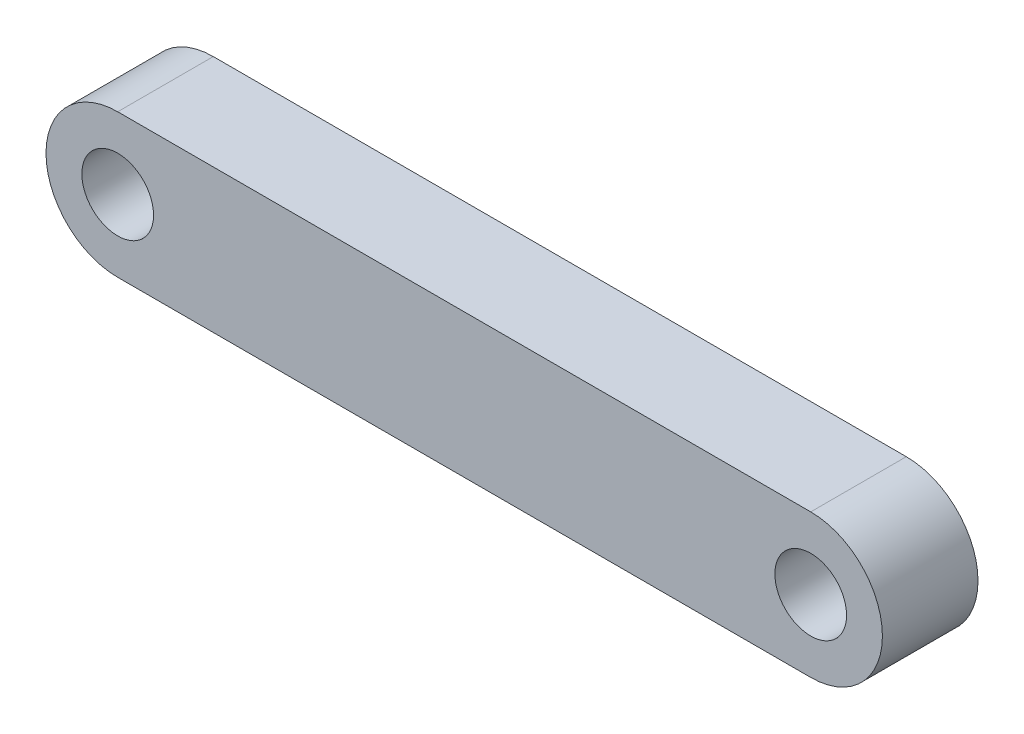
ISO-10303-21;
HEADER;
FILE_DESCRIPTION(('STEP AP214'),'2;1');
FILE_NAME('part.step','',(''),(''),'','','');
FILE_SCHEMA(('AUTOMOTIVE_DESIGN { 1 0 10303 214 1 1 1 1 }'));
ENDSEC;
DATA;
#1=APPLICATION_CONTEXT('core data for automotive mechanical design processes');
#2=APPLICATION_PROTOCOL_DEFINITION('international standard','automotive_design',2000,#1);
#3=PRODUCT_CONTEXT('',#1,'mechanical');
#4=PRODUCT('Part','Part','',(#3));
#5=PRODUCT_RELATED_PRODUCT_CATEGORY('part','',(#4));
#6=PRODUCT_DEFINITION_FORMATION('','',#4);
#7=PRODUCT_DEFINITION_CONTEXT('part definition',#1,'design');
#8=PRODUCT_DEFINITION('design','',#6,#7);
#9=PRODUCT_DEFINITION_SHAPE('','',#8);
#10=(LENGTH_UNIT() NAMED_UNIT(*) SI_UNIT(.MILLI.,.METRE.));
#11=(NAMED_UNIT(*) PLANE_ANGLE_UNIT() SI_UNIT($,.RADIAN.));
#12=(NAMED_UNIT(*) SI_UNIT($,.STERADIAN.) SOLID_ANGLE_UNIT());
#13=UNCERTAINTY_MEASURE_WITH_UNIT(LENGTH_MEASURE(1.E-05),#10,'distance_accuracy_value','');
#14=(GEOMETRIC_REPRESENTATION_CONTEXT(3) GLOBAL_UNCERTAINTY_ASSIGNED_CONTEXT((#13)) GLOBAL_UNIT_ASSIGNED_CONTEXT((#10,
#11,#12)) REPRESENTATION_CONTEXT('',''));
#15=CARTESIAN_POINT('',(0.,0.,0.));
#16=DIRECTION('',(0.,0.,1.));
#17=DIRECTION('',(1.,0.,0.));
#18=AXIS2_PLACEMENT_3D('',#15,#16,#17);
#19=CARTESIAN_POINT('',(3.00000002165552,3.00000002607703,8.00000018998981));
#20=DIRECTION('',(0.,0.,1.));
#21=DIRECTION('',(1.,0.,0.));
#22=AXIS2_PLACEMENT_3D('',#19,#20,#21);
#23=PLANE('',#22);
#24=CARTESIAN_POINT('',(2.99999964016233,3.00000008428469,8.00000018998981));
#25=DIRECTION('',(0.,0.,1.));
#26=DIRECTION('',(1.,0.,0.));
#27=AXIS2_PLACEMENT_3D('',#24,#25,#26);
#28=CIRCLE('',#27,1.49999993908166);
#29=CARTESIAN_POINT('',(4.49999957924399,3.00000008428469,8.00000018998981));
#30=VERTEX_POINT('',#29);
#31=EDGE_CURVE('E116',#30,#30,#28,.T.);
#32=ORIENTED_EDGE('',*,*,#31,.F.);
#33=EDGE_LOOP('',(#32));
#34=FACE_BOUND('',#33,.T.);
#35=CARTESIAN_POINT('',(3.00000002165552,3.00000002607703,8.00000018998981));
#36=DIRECTION('',(0.,0.,1.));
#37=DIRECTION('',(1.,0.,0.));
#38=AXIS2_PLACEMENT_3D('',#35,#36,#37);
#39=CIRCLE('',#38,3.00000002607703);
#40=CARTESIAN_POINT('',(3.00000002165552,6.00000005215406,8.00000018998981));
#41=VERTEX_POINT('',#40);
#42=CARTESIAN_POINT('',(3.00000002165552,0.,8.00000018998981));
#43=VERTEX_POINT('',#42);
#44=EDGE_CURVE('E96',#41,#43,#39,.T.);
#45=ORIENTED_EDGE('',*,*,#44,.T.);
#46=DIRECTION('',(1.,0.,0.));
#47=VECTOR('',#46,1.);
#48=CARTESIAN_POINT('',(3.00000002165552,0.,8.00000018998981));
#49=LINE('',#48,#47);
#50=CARTESIAN_POINT('',(31.9999983747598,0.,8.00000018998981));
#51=VERTEX_POINT('',#50);
#52=EDGE_CURVE('E91',#43,#51,#49,.T.);
#53=ORIENTED_EDGE('',*,*,#52,.T.);
#54=CARTESIAN_POINT('',(31.9999983747598,3.00000002607704,8.00000018998981));
#55=DIRECTION('',(0.,0.,1.));
#56=DIRECTION('',(1.,0.,0.));
#57=AXIS2_PLACEMENT_3D('',#54,#55,#56);
#58=CIRCLE('',#57,3.00000002607707);
#59=CARTESIAN_POINT('',(31.9999983747598,6.00000005215412,8.00000018998981));
#60=VERTEX_POINT('',#59);
#61=EDGE_CURVE('E94',#51,#60,#58,.T.);
#62=ORIENTED_EDGE('',*,*,#61,.T.);
#63=DIRECTION('',(-1.,0.,0.));
#64=VECTOR('',#63,1.);
#65=CARTESIAN_POINT('',(3.00000002165552,6.00000005215406,8.00000018998981));
#66=LINE('',#65,#64);
#67=EDGE_CURVE('E61',#60,#41,#66,.T.);
#68=ORIENTED_EDGE('',*,*,#67,.T.);
#69=EDGE_LOOP('',(#45,#53,#62,#68));
#70=FACE_BOUND('',#69,.T.);
#71=CARTESIAN_POINT('',(31.9999991781228,3.00000002607703,8.00000018998981));
#72=DIRECTION('',(0.,0.,1.));
#73=DIRECTION('',(1.,0.,0.));
#74=AXIS2_PLACEMENT_3D('',#71,#72,#73);
#75=CIRCLE('',#74,1.50000002704519);
#76=CARTESIAN_POINT('',(33.499999205168,3.00000002607703,8.00000018998981));
#77=VERTEX_POINT('',#76);
#78=EDGE_CURVE('E138',#77,#77,#75,.T.);
#79=ORIENTED_EDGE('',*,*,#78,.F.);
#80=EDGE_LOOP('',(#79));
#81=FACE_BOUND('',#80,.T.);
#82=ADVANCED_FACE('F43',(#34,#70,#81),#23,.T.);
#83=CARTESIAN_POINT('',(3.00000002165552,3.00000002607703,4.00000018998981));
#84=DIRECTION('',(0.,0.,1.));
#85=DIRECTION('',(1.,0.,0.));
#86=AXIS2_PLACEMENT_3D('',#83,#84,#85);
#87=PLANE('',#86);
#88=CARTESIAN_POINT('',(3.00000002165552,3.00000002607703,4.00000018998981));
#89=DIRECTION('',(0.,0.,1.));
#90=DIRECTION('',(1.,0.,0.));
#91=AXIS2_PLACEMENT_3D('',#88,#89,#90);
#92=CIRCLE('',#91,3.00000002607703);
#93=CARTESIAN_POINT('',(3.00000002165552,6.00000005215406,4.00000018998981));
#94=VERTEX_POINT('',#93);
#95=CARTESIAN_POINT('',(3.00000002165552,0.,4.00000018998981));
#96=VERTEX_POINT('',#95);
#97=EDGE_CURVE('E112',#94,#96,#92,.T.);
#98=ORIENTED_EDGE('',*,*,#97,.F.);
#99=DIRECTION('',(-1.,0.,0.));
#100=VECTOR('',#99,1.);
#101=CARTESIAN_POINT('',(3.00000002165552,6.00000005215406,4.00000018998981));
#102=LINE('',#101,#100);
#103=CARTESIAN_POINT('',(31.9999983747598,6.00000005215412,4.00000018998981));
#104=VERTEX_POINT('',#103);
#105=EDGE_CURVE('E84',#104,#94,#102,.T.);
#106=ORIENTED_EDGE('',*,*,#105,.F.);
#107=CARTESIAN_POINT('',(31.9999983747598,3.00000002607704,4.00000018998981));
#108=DIRECTION('',(0.,0.,1.));
#109=DIRECTION('',(1.,0.,0.));
#110=AXIS2_PLACEMENT_3D('',#107,#108,#109);
#111=CIRCLE('',#110,3.00000002607707);
#112=CARTESIAN_POINT('',(31.9999983747598,0.,4.00000018998981));
#113=VERTEX_POINT('',#112);
#114=EDGE_CURVE('E78',#113,#104,#111,.T.);
#115=ORIENTED_EDGE('',*,*,#114,.F.);
#116=DIRECTION('',(1.,0.,0.));
#117=VECTOR('',#116,1.);
#118=CARTESIAN_POINT('',(3.00000002165552,0.,4.00000018998981));
#119=LINE('',#118,#117);
#120=EDGE_CURVE('E101',#96,#113,#119,.T.);
#121=ORIENTED_EDGE('',*,*,#120,.F.);
#122=EDGE_LOOP('',(#98,#106,#115,#121));
#123=FACE_BOUND('',#122,.T.);
#124=CARTESIAN_POINT('',(2.99999964016233,3.00000008428469,4.00000018998981));
#125=DIRECTION('',(0.,0.,1.));
#126=DIRECTION('',(1.,0.,0.));
#127=AXIS2_PLACEMENT_3D('',#124,#125,#126);
#128=CIRCLE('',#127,1.49999993908166);
#129=CARTESIAN_POINT('',(4.49999957924399,3.00000008428469,4.00000018998981));
#130=VERTEX_POINT('',#129);
#131=EDGE_CURVE('E134',#130,#130,#128,.T.);
#132=ORIENTED_EDGE('',*,*,#131,.T.);
#133=EDGE_LOOP('',(#132));
#134=FACE_BOUND('',#133,.T.);
#135=CARTESIAN_POINT('',(31.9999991781228,3.00000002607703,4.00000018998981));
#136=DIRECTION('',(0.,0.,1.));
#137=DIRECTION('',(1.,0.,0.));
#138=AXIS2_PLACEMENT_3D('',#135,#136,#137);
#139=CIRCLE('',#138,1.50000002704519);
#140=CARTESIAN_POINT('',(33.499999205168,3.00000002607703,4.00000018998981));
#141=VERTEX_POINT('',#140);
#142=EDGE_CURVE('E142',#141,#141,#139,.T.);
#143=ORIENTED_EDGE('',*,*,#142,.T.);
#144=EDGE_LOOP('',(#143));
#145=FACE_BOUND('',#144,.T.);
#146=ADVANCED_FACE('F129',(#123,#134,#145),#87,.F.);
#147=CARTESIAN_POINT('',(3.00000002165552,3.00000002607703,8.00000018998981));
#148=DIRECTION('',(0.,0.,-1.));
#149=DIRECTION('',(-1.,0.,0.));
#150=AXIS2_PLACEMENT_3D('',#147,#148,#149);
#151=CYLINDRICAL_SURFACE('',#150,3.00000002607703);
#152=ORIENTED_EDGE('',*,*,#97,.T.);
#153=DIRECTION('',(0.,0.,-1.));
#154=VECTOR('',#153,1.);
#155=CARTESIAN_POINT('',(3.00000002165552,0.,8.00000018998981));
#156=LINE('',#155,#154);
#157=EDGE_CURVE('E11',#43,#96,#156,.T.);
#158=ORIENTED_EDGE('',*,*,#157,.F.);
#159=ORIENTED_EDGE('',*,*,#44,.F.);
#160=DIRECTION('',(0.,0.,-1.));
#161=VECTOR('',#160,1.);
#162=CARTESIAN_POINT('',(3.00000002165552,6.00000005215406,8.00000018998981));
#163=LINE('',#162,#161);
#164=EDGE_CURVE('E108',#41,#94,#163,.T.);
#165=ORIENTED_EDGE('',*,*,#164,.T.);
#166=EDGE_LOOP('',(#152,#158,#159,#165));
#167=FACE_BOUND('',#166,.T.);
#168=ADVANCED_FACE('F45',(#167),#151,.T.);
#169=CARTESIAN_POINT('',(3.00000002165552,0.,8.00000018998981));
#170=DIRECTION('',(0.,1.,0.));
#171=DIRECTION('',(-1.,0.,0.));
#172=AXIS2_PLACEMENT_3D('',#169,#170,#171);
#173=PLANE('',#172);
#174=ORIENTED_EDGE('',*,*,#120,.T.);
#175=DIRECTION('',(0.,0.,-1.));
#176=VECTOR('',#175,1.);
#177=CARTESIAN_POINT('',(31.9999983747598,0.,8.00000018998981));
#178=LINE('',#177,#176);
#179=EDGE_CURVE('E53',#51,#113,#178,.T.);
#180=ORIENTED_EDGE('',*,*,#179,.F.);
#181=ORIENTED_EDGE('',*,*,#52,.F.);
#182=ORIENTED_EDGE('',*,*,#157,.T.);
#183=EDGE_LOOP('',(#174,#180,#181,#182));
#184=FACE_BOUND('',#183,.T.);
#185=ADVANCED_FACE('F100',(#184),#173,.F.);
#186=CARTESIAN_POINT('',(31.9999983747598,3.00000002607704,8.00000018998981));
#187=DIRECTION('',(0.,0.,-1.));
#188=DIRECTION('',(-1.,0.,0.));
#189=AXIS2_PLACEMENT_3D('',#186,#187,#188);
#190=CYLINDRICAL_SURFACE('',#189,3.00000002607707);
#191=ORIENTED_EDGE('',*,*,#114,.T.);
#192=DIRECTION('',(0.,0.,-1.));
#193=VECTOR('',#192,1.);
#194=CARTESIAN_POINT('',(31.9999983747598,6.00000005215412,8.00000018998981));
#195=LINE('',#194,#193);
#196=EDGE_CURVE('E103',#60,#104,#195,.T.);
#197=ORIENTED_EDGE('',*,*,#196,.F.);
#198=ORIENTED_EDGE('',*,*,#61,.F.);
#199=ORIENTED_EDGE('',*,*,#179,.T.);
#200=EDGE_LOOP('',(#191,#197,#198,#199));
#201=FACE_BOUND('',#200,.T.);
#202=ADVANCED_FACE('F104',(#201),#190,.T.);
#203=CARTESIAN_POINT('',(3.00000002165552,6.00000005215406,8.00000018998981));
#204=DIRECTION('',(0.,-1.,0.));
#205=DIRECTION('',(1.,0.,0.));
#206=AXIS2_PLACEMENT_3D('',#203,#204,#205);
#207=PLANE('',#206);
#208=ORIENTED_EDGE('',*,*,#105,.T.);
#209=ORIENTED_EDGE('',*,*,#164,.F.);
#210=ORIENTED_EDGE('',*,*,#67,.F.);
#211=ORIENTED_EDGE('',*,*,#196,.T.);
#212=EDGE_LOOP('',(#208,#209,#210,#211));
#213=FACE_BOUND('',#212,.T.);
#214=ADVANCED_FACE('F126',(#213),#207,.F.);
#215=CARTESIAN_POINT('',(2.99999964016233,3.00000008428469,8.00000018998981));
#216=DIRECTION('',(0.,0.,-1.));
#217=DIRECTION('',(-1.,0.,0.));
#218=AXIS2_PLACEMENT_3D('',#215,#216,#217);
#219=CYLINDRICAL_SURFACE('',#218,1.49999993908166);
#220=ORIENTED_EDGE('',*,*,#31,.T.);
#221=EDGE_LOOP('',(#220));
#222=FACE_BOUND('',#221,.T.);
#223=ORIENTED_EDGE('',*,*,#131,.F.);
#224=EDGE_LOOP('',(#223));
#225=FACE_BOUND('',#224,.T.);
#226=ADVANCED_FACE('F161',(#222,#225),#219,.F.);
#227=CARTESIAN_POINT('',(31.9999991781228,3.00000002607703,8.00000018998981));
#228=DIRECTION('',(0.,0.,-1.));
#229=DIRECTION('',(-1.,0.,0.));
#230=AXIS2_PLACEMENT_3D('',#227,#228,#229);
#231=CYLINDRICAL_SURFACE('',#230,1.50000002704519);
#232=ORIENTED_EDGE('',*,*,#78,.T.);
#233=EDGE_LOOP('',(#232));
#234=FACE_BOUND('',#233,.T.);
#235=ORIENTED_EDGE('',*,*,#142,.F.);
#236=EDGE_LOOP('',(#235));
#237=FACE_BOUND('',#236,.T.);
#238=ADVANCED_FACE('F150',(#234,#237),#231,.F.);
#239=CLOSED_SHELL('',(#82,#146,#168,#185,#202,#214,#226,#238));
#240=MANIFOLD_SOLID_BREP('B2',#239);
#241=ADVANCED_BREP_SHAPE_REPRESENTATION('',(#18,#240),#14);
#242=SHAPE_DEFINITION_REPRESENTATION(#9,#241);
ENDSEC;
END-ISO-10303-21;
